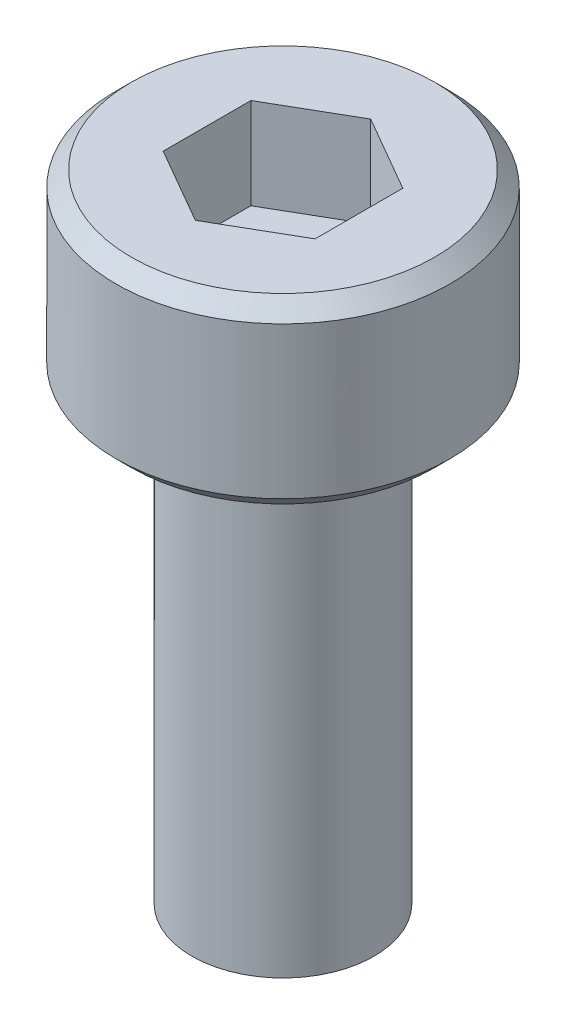
ISO-10303-21;
HEADER;
FILE_DESCRIPTION(('STEP AP214'),'2;1');
FILE_NAME('part.step','',(''),(''),'','','');
FILE_SCHEMA(('AUTOMOTIVE_DESIGN { 1 0 10303 214 1 1 1 1 }'));
ENDSEC;
DATA;
#1=APPLICATION_CONTEXT('core data for automotive mechanical design processes');
#2=APPLICATION_PROTOCOL_DEFINITION('international standard','automotive_design',2000,#1);
#3=PRODUCT_CONTEXT('',#1,'mechanical');
#4=PRODUCT('Part','Part','',(#3));
#5=PRODUCT_RELATED_PRODUCT_CATEGORY('part','',(#4));
#6=PRODUCT_DEFINITION_FORMATION('','',#4);
#7=PRODUCT_DEFINITION_CONTEXT('part definition',#1,'design');
#8=PRODUCT_DEFINITION('design','',#6,#7);
#9=PRODUCT_DEFINITION_SHAPE('','',#8);
#10=(LENGTH_UNIT() NAMED_UNIT(*) SI_UNIT(.MILLI.,.METRE.));
#11=(NAMED_UNIT(*) PLANE_ANGLE_UNIT() SI_UNIT($,.RADIAN.));
#12=(NAMED_UNIT(*) SI_UNIT($,.STERADIAN.) SOLID_ANGLE_UNIT());
#13=UNCERTAINTY_MEASURE_WITH_UNIT(LENGTH_MEASURE(1.E-05),#10,'distance_accuracy_value','');
#14=(GEOMETRIC_REPRESENTATION_CONTEXT(3) GLOBAL_UNCERTAINTY_ASSIGNED_CONTEXT((#13)) GLOBAL_UNIT_ASSIGNED_CONTEXT((#10,
#11,#12)) REPRESENTATION_CONTEXT('',''));
#15=CARTESIAN_POINT('',(0.,0.,0.));
#16=DIRECTION('',(0.,0.,1.));
#17=DIRECTION('',(1.,0.,0.));
#18=AXIS2_PLACEMENT_3D('',#15,#16,#17);
#19=CARTESIAN_POINT('',(-1.25,1.5,0.721687836487032));
#20=DIRECTION('',(0.,-1.,0.));
#21=DIRECTION('',(0.,0.,-1.));
#22=AXIS2_PLACEMENT_3D('',#19,#20,#21);
#23=PLANE('',#22);
#24=DIRECTION('',(0.866025403784439,0.,-0.5));
#25=VECTOR('',#24,1.);
#26=CARTESIAN_POINT('',(0.,1.5,1.44337567297406));
#27=LINE('',#26,#25);
#28=CARTESIAN_POINT('',(0.,1.5,1.44337567297406));
#29=VERTEX_POINT('',#28);
#30=CARTESIAN_POINT('',(1.25,1.5,0.721687836487032));
#31=VERTEX_POINT('',#30);
#32=EDGE_CURVE('E126',#29,#31,#27,.T.);
#33=ORIENTED_EDGE('',*,*,#32,.T.);
#34=DIRECTION('',(0.,0.,-1.));
#35=VECTOR('',#34,1.);
#36=CARTESIAN_POINT('',(1.25,1.5,0.721687836487032));
#37=LINE('',#36,#35);
#38=CARTESIAN_POINT('',(1.25,1.5,-0.721687836487032));
#39=VERTEX_POINT('',#38);
#40=EDGE_CURVE('E131',#31,#39,#37,.T.);
#41=ORIENTED_EDGE('',*,*,#40,.T.);
#42=DIRECTION('',(-0.866025403784439,0.,-0.5));
#43=VECTOR('',#42,1.);
#44=CARTESIAN_POINT('',(1.25,1.5,-0.721687836487032));
#45=LINE('',#44,#43);
#46=CARTESIAN_POINT('',(0.,1.5,-1.44337567297406));
#47=VERTEX_POINT('',#46);
#48=EDGE_CURVE('E135',#39,#47,#45,.T.);
#49=ORIENTED_EDGE('',*,*,#48,.T.);
#50=DIRECTION('',(-0.866025403784439,0.,0.5));
#51=VECTOR('',#50,1.);
#52=CARTESIAN_POINT('',(0.,1.5,-1.44337567297406));
#53=LINE('',#52,#51);
#54=CARTESIAN_POINT('',(-1.25,1.5,-0.721687836487032));
#55=VERTEX_POINT('',#54);
#56=EDGE_CURVE('E67',#47,#55,#53,.T.);
#57=ORIENTED_EDGE('',*,*,#56,.T.);
#58=DIRECTION('',(0.,0.,1.));
#59=VECTOR('',#58,1.);
#60=CARTESIAN_POINT('',(-1.25,1.5,-0.721687836487032));
#61=LINE('',#60,#59);
#62=CARTESIAN_POINT('',(-1.25,1.5,0.721687836487033));
#63=VERTEX_POINT('',#62);
#64=EDGE_CURVE('E69',#55,#63,#61,.T.);
#65=ORIENTED_EDGE('',*,*,#64,.T.);
#66=DIRECTION('',(0.866025403784439,0.,0.5));
#67=VECTOR('',#66,1.);
#68=CARTESIAN_POINT('',(-1.25,1.5,0.721687836487032));
#69=LINE('',#68,#67);
#70=EDGE_CURVE('E71',#63,#29,#69,.T.);
#71=ORIENTED_EDGE('',*,*,#70,.T.);
#72=EDGE_LOOP('',(#33,#41,#49,#57,#65,#71));
#73=FACE_BOUND('',#72,.T.);
#74=ADVANCED_FACE('F16',(#73),#23,.F.);
#75=CARTESIAN_POINT('',(-1.25,1.5,0.721687836487032));
#76=DIRECTION('',(-0.5,0.,0.866025403784439));
#77=DIRECTION('',(0.866025403784439,0.,0.5));
#78=AXIS2_PLACEMENT_3D('',#75,#76,#77);
#79=PLANE('',#78);
#80=DIRECTION('',(0.,1.,0.));
#81=VECTOR('',#80,1.);
#82=CARTESIAN_POINT('',(0.,1.5,1.44337567297406));
#83=LINE('',#82,#81);
#84=CARTESIAN_POINT('',(0.,3.,1.44337567297406));
#85=VERTEX_POINT('',#84);
#86=EDGE_CURVE('E82',#85,#29,#83,.F.);
#87=ORIENTED_EDGE('',*,*,#86,.T.);
#88=ORIENTED_EDGE('',*,*,#70,.F.);
#89=DIRECTION('',(0.,1.,0.));
#90=VECTOR('',#89,1.);
#91=CARTESIAN_POINT('',(-1.25,1.5,0.721687836487032));
#92=LINE('',#91,#90);
#93=CARTESIAN_POINT('',(-1.25,3.,0.721687836487032));
#94=VERTEX_POINT('',#93);
#95=EDGE_CURVE('E76',#63,#94,#92,.T.);
#96=ORIENTED_EDGE('',*,*,#95,.T.);
#97=DIRECTION('',(-0.866025403784439,0.,-0.5));
#98=VECTOR('',#97,1.);
#99=CARTESIAN_POINT('',(0.,3.,1.44337567297406));
#100=LINE('',#99,#98);
#101=EDGE_CURVE('E123',#85,#94,#100,.T.);
#102=ORIENTED_EDGE('',*,*,#101,.F.);
#103=EDGE_LOOP('',(#87,#88,#96,#102));
#104=FACE_BOUND('',#103,.T.);
#105=ADVANCED_FACE('F79',(#104),#79,.F.);
#106=CARTESIAN_POINT('',(-1.25,1.5,-0.721687836487032));
#107=DIRECTION('',(-1.,0.,0.));
#108=DIRECTION('',(0.,0.,1.));
#109=AXIS2_PLACEMENT_3D('',#106,#107,#108);
#110=PLANE('',#109);
#111=ORIENTED_EDGE('',*,*,#95,.F.);
#112=ORIENTED_EDGE('',*,*,#64,.F.);
#113=DIRECTION('',(0.,1.,0.));
#114=VECTOR('',#113,1.);
#115=CARTESIAN_POINT('',(-1.25,1.5,-0.721687836487032));
#116=LINE('',#115,#114);
#117=CARTESIAN_POINT('',(-1.25,3.,-0.721687836487032));
#118=VERTEX_POINT('',#117);
#119=EDGE_CURVE('E90',#55,#118,#116,.T.);
#120=ORIENTED_EDGE('',*,*,#119,.T.);
#121=DIRECTION('',(0.,0.,1.));
#122=VECTOR('',#121,1.);
#123=CARTESIAN_POINT('',(-1.25,3.,0.));
#124=LINE('',#123,#122);
#125=EDGE_CURVE('E87',#94,#118,#124,.F.);
#126=ORIENTED_EDGE('',*,*,#125,.F.);
#127=EDGE_LOOP('',(#111,#112,#120,#126));
#128=FACE_BOUND('',#127,.T.);
#129=ADVANCED_FACE('F85',(#128),#110,.F.);
#130=CARTESIAN_POINT('',(0.,1.5,-1.44337567297406));
#131=DIRECTION('',(-0.5,0.,-0.866025403784439));
#132=DIRECTION('',(-0.866025403784439,0.,0.5));
#133=AXIS2_PLACEMENT_3D('',#130,#131,#132);
#134=PLANE('',#133);
#135=ORIENTED_EDGE('',*,*,#119,.F.);
#136=ORIENTED_EDGE('',*,*,#56,.F.);
#137=DIRECTION('',(0.,1.,0.));
#138=VECTOR('',#137,1.);
#139=CARTESIAN_POINT('',(0.,1.5,-1.44337567297406));
#140=LINE('',#139,#138);
#141=CARTESIAN_POINT('',(0.,3.,-1.44337567297406));
#142=VERTEX_POINT('',#141);
#143=EDGE_CURVE('E133',#47,#142,#140,.T.);
#144=ORIENTED_EDGE('',*,*,#143,.T.);
#145=DIRECTION('',(0.866025403784439,0.,-0.5));
#146=VECTOR('',#145,1.);
#147=CARTESIAN_POINT('',(-1.25,3.,-0.721687836487032));
#148=LINE('',#147,#146);
#149=EDGE_CURVE('E119',#118,#142,#148,.T.);
#150=ORIENTED_EDGE('',*,*,#149,.F.);
#151=EDGE_LOOP('',(#135,#136,#144,#150));
#152=FACE_BOUND('',#151,.T.);
#153=ADVANCED_FACE('F138',(#152),#134,.F.);
#154=CARTESIAN_POINT('',(1.25,1.5,-0.721687836487032));
#155=DIRECTION('',(0.5,0.,-0.866025403784439));
#156=DIRECTION('',(-0.866025403784439,0.,-0.5));
#157=AXIS2_PLACEMENT_3D('',#154,#155,#156);
#158=PLANE('',#157);
#159=ORIENTED_EDGE('',*,*,#143,.F.);
#160=ORIENTED_EDGE('',*,*,#48,.F.);
#161=DIRECTION('',(0.,1.,0.));
#162=VECTOR('',#161,1.);
#163=CARTESIAN_POINT('',(1.25,1.5,-0.721687836487032));
#164=LINE('',#163,#162);
#165=CARTESIAN_POINT('',(1.25,3.,-0.721687836487032));
#166=VERTEX_POINT('',#165);
#167=EDGE_CURVE('E129',#39,#166,#164,.T.);
#168=ORIENTED_EDGE('',*,*,#167,.T.);
#169=DIRECTION('',(0.866025403784438,0.,0.5));
#170=VECTOR('',#169,1.);
#171=CARTESIAN_POINT('',(0.,3.,-1.44337567297406));
#172=LINE('',#171,#170);
#173=EDGE_CURVE('E116',#142,#166,#172,.T.);
#174=ORIENTED_EDGE('',*,*,#173,.F.);
#175=EDGE_LOOP('',(#159,#160,#168,#174));
#176=FACE_BOUND('',#175,.T.);
#177=ADVANCED_FACE('F150',(#176),#158,.F.);
#178=CARTESIAN_POINT('',(1.25,1.5,0.721687836487032));
#179=DIRECTION('',(1.,0.,0.));
#180=DIRECTION('',(0.,0.,-1.));
#181=AXIS2_PLACEMENT_3D('',#178,#179,#180);
#182=PLANE('',#181);
#183=ORIENTED_EDGE('',*,*,#167,.F.);
#184=ORIENTED_EDGE('',*,*,#40,.F.);
#185=DIRECTION('',(0.,1.,0.));
#186=VECTOR('',#185,1.);
#187=CARTESIAN_POINT('',(1.25,1.5,0.721687836487032));
#188=LINE('',#187,#186);
#189=CARTESIAN_POINT('',(1.25,3.,0.721687836487032));
#190=VERTEX_POINT('',#189);
#191=EDGE_CURVE('E34',#31,#190,#188,.T.);
#192=ORIENTED_EDGE('',*,*,#191,.T.);
#193=DIRECTION('',(0.,0.,1.));
#194=VECTOR('',#193,1.);
#195=CARTESIAN_POINT('',(1.25,3.,0.));
#196=LINE('',#195,#194);
#197=EDGE_CURVE('E113',#166,#190,#196,.T.);
#198=ORIENTED_EDGE('',*,*,#197,.F.);
#199=EDGE_LOOP('',(#183,#184,#192,#198));
#200=FACE_BOUND('',#199,.T.);
#201=ADVANCED_FACE('F148',(#200),#182,.F.);
#202=CARTESIAN_POINT('',(0.,1.5,1.44337567297406));
#203=DIRECTION('',(0.5,0.,0.866025403784439));
#204=DIRECTION('',(0.866025403784439,0.,-0.5));
#205=AXIS2_PLACEMENT_3D('',#202,#203,#204);
#206=PLANE('',#205);
#207=ORIENTED_EDGE('',*,*,#191,.F.);
#208=ORIENTED_EDGE('',*,*,#32,.F.);
#209=ORIENTED_EDGE('',*,*,#86,.F.);
#210=DIRECTION('',(-0.866025403784439,0.,0.5));
#211=VECTOR('',#210,1.);
#212=CARTESIAN_POINT('',(1.25,3.,0.721687836487032));
#213=LINE('',#212,#211);
#214=EDGE_CURVE('E110',#190,#85,#213,.T.);
#215=ORIENTED_EDGE('',*,*,#214,.F.);
#216=EDGE_LOOP('',(#207,#208,#209,#215));
#217=FACE_BOUND('',#216,.T.);
#218=ADVANCED_FACE('F145',(#217),#206,.F.);
#219=CARTESIAN_POINT('',(0.,3.,0.));
#220=DIRECTION('',(0.,1.,0.));
#221=DIRECTION('',(0.,0.,1.));
#222=AXIS2_PLACEMENT_3D('',#219,#220,#221);
#223=PLANE('',#222);
#224=ORIENTED_EDGE('',*,*,#197,.T.);
#225=ORIENTED_EDGE('',*,*,#214,.T.);
#226=ORIENTED_EDGE('',*,*,#101,.T.);
#227=ORIENTED_EDGE('',*,*,#125,.T.);
#228=ORIENTED_EDGE('',*,*,#149,.T.);
#229=ORIENTED_EDGE('',*,*,#173,.T.);
#230=EDGE_LOOP('',(#224,#225,#226,#227,#228,#229));
#231=FACE_BOUND('',#230,.T.);
#232=CARTESIAN_POINT('',(0.,3.00000000004275,0.));
#233=DIRECTION('',(0.,-1.,0.));
#234=DIRECTION('',(0.,0.,-1.));
#235=AXIS2_PLACEMENT_3D('',#232,#233,#234);
#236=CIRCLE('',#235,2.49600000000783);
#237=CARTESIAN_POINT('',(0.,3.00000000004275,-2.49600000000783));
#238=VERTEX_POINT('',#237);
#239=EDGE_CURVE('E19',#238,#238,#236,.T.);
#240=ORIENTED_EDGE('',*,*,#239,.F.);
#241=EDGE_LOOP('',(#240));
#242=FACE_BOUND('',#241,.T.);
#243=ADVANCED_FACE('F142',(#231,#242),#223,.T.);
#244=CARTESIAN_POINT('',(0.,2.7460000001156,0.));
#245=DIRECTION('',(0.,-1.,0.));
#246=DIRECTION('',(0.,0.,-1.));
#247=AXIS2_PLACEMENT_3D('',#244,#245,#246);
#248=CONICAL_SURFACE('',#247,2.74999999993497,0.785398163397448);
#249=ORIENTED_EDGE('',*,*,#239,.T.);
#250=EDGE_LOOP('',(#249));
#251=FACE_BOUND('',#250,.T.);
#252=CARTESIAN_POINT('',(0.,2.746,0.));
#253=DIRECTION('',(0.,-1.,0.));
#254=DIRECTION('',(0.,0.,-1.));
#255=AXIS2_PLACEMENT_3D('',#252,#253,#254);
#256=CIRCLE('',#255,2.75);
#257=CARTESIAN_POINT('',(0.,2.746,-2.75));
#258=VERTEX_POINT('',#257);
#259=EDGE_CURVE('E102',#258,#258,#256,.T.);
#260=ORIENTED_EDGE('',*,*,#259,.F.);
#261=EDGE_LOOP('',(#260));
#262=FACE_BOUND('',#261,.T.);
#263=ADVANCED_FACE('F187',(#251,#262),#248,.T.);
#264=CARTESIAN_POINT('',(0.,3.,0.));
#265=DIRECTION('',(0.,-1.,0.));
#266=DIRECTION('',(0.,0.,-1.));
#267=AXIS2_PLACEMENT_3D('',#264,#265,#266);
#268=CYLINDRICAL_SURFACE('',#267,2.75);
#269=ORIENTED_EDGE('',*,*,#259,.T.);
#270=EDGE_LOOP('',(#269));
#271=FACE_BOUND('',#270,.T.);
#272=CARTESIAN_POINT('',(0.,0.253999999983989,0.));
#273=DIRECTION('',(0.,1.,0.));
#274=DIRECTION('',(0.,0.,1.));
#275=AXIS2_PLACEMENT_3D('',#272,#273,#274);
#276=CIRCLE('',#275,2.74999999999181);
#277=CARTESIAN_POINT('',(0.,0.253999999983989,2.74999999999181));
#278=VERTEX_POINT('',#277);
#279=EDGE_CURVE('E98',#278,#278,#276,.F.);
#280=ORIENTED_EDGE('',*,*,#279,.F.);
#281=EDGE_LOOP('',(#280));
#282=FACE_BOUND('',#281,.T.);
#283=ADVANCED_FACE('F183',(#271,#282),#268,.T.);
#284=CARTESIAN_POINT('',(0.,-8.,0.));
#285=DIRECTION('',(0.,1.,0.));
#286=DIRECTION('',(0.,0.,1.));
#287=AXIS2_PLACEMENT_3D('',#284,#285,#286);
#288=PLANE('',#287);
#289=CARTESIAN_POINT('',(0.,-7.99999999998136,0.));
#290=DIRECTION('',(0.,1.,0.));
#291=DIRECTION('',(-1.,0.,0.));
#292=AXIS2_PLACEMENT_3D('',#289,#290,#291);
#293=CIRCLE('',#292,0.730379999993147);
#294=CARTESIAN_POINT('',(-0.730379999993147,-7.99999999998136,0.));
#295=VERTEX_POINT('',#294);
#296=EDGE_CURVE('E96',#295,#295,#293,.T.);
#297=ORIENTED_EDGE('',*,*,#296,.F.);
#298=EDGE_LOOP('',(#297));
#299=FACE_BOUND('',#298,.T.);
#300=ADVANCED_FACE('F179',(#299),#288,.F.);
#301=CARTESIAN_POINT('',(0.,0.254000000040833,0.));
#302=DIRECTION('',(0.,1.,0.));
#303=DIRECTION('',(0.,0.,1.));
#304=AXIS2_PLACEMENT_3D('',#301,#302,#303);
#305=CONICAL_SURFACE('',#304,2.7500000001055,0.785398163397448);
#306=CARTESIAN_POINT('',(0.,0.,0.));
#307=DIRECTION('',(0.,1.,0.));
#308=DIRECTION('',(0.,0.,1.));
#309=AXIS2_PLACEMENT_3D('',#306,#307,#308);
#310=CIRCLE('',#309,2.49600000006467);
#311=CARTESIAN_POINT('',(0.,0.,2.49600000006467));
#312=VERTEX_POINT('',#311);
#313=EDGE_CURVE('E94',#312,#312,#310,.T.);
#314=ORIENTED_EDGE('',*,*,#313,.T.);
#315=EDGE_LOOP('',(#314));
#316=FACE_BOUND('',#315,.T.);
#317=ORIENTED_EDGE('',*,*,#279,.T.);
#318=EDGE_LOOP('',(#317));
#319=FACE_BOUND('',#318,.T.);
#320=ADVANCED_FACE('F175',(#316,#319),#305,.T.);
#321=CARTESIAN_POINT('',(0.,-7.46151999993572,0.));
#322=DIRECTION('',(0.,1.,0.));
#323=DIRECTION('',(-1.,0.,0.));
#324=AXIS2_PLACEMENT_3D('',#321,#322,#323);
#325=CONICAL_SURFACE('',#324,1.50000000002137,0.960291895387899);
#326=CARTESIAN_POINT('',(0.,-7.46152,0.));
#327=DIRECTION('',(0.,1.,0.));
#328=DIRECTION('',(0.,0.,1.));
#329=AXIS2_PLACEMENT_3D('',#326,#327,#328);
#330=CIRCLE('',#329,1.5);
#331=CARTESIAN_POINT('',(0.,-7.46152,1.5));
#332=VERTEX_POINT('',#331);
#333=EDGE_CURVE('E25',#332,#332,#330,.T.);
#334=ORIENTED_EDGE('',*,*,#333,.F.);
#335=EDGE_LOOP('',(#334));
#336=FACE_BOUND('',#335,.T.);
#337=ORIENTED_EDGE('',*,*,#296,.T.);
#338=EDGE_LOOP('',(#337));
#339=FACE_BOUND('',#338,.T.);
#340=ADVANCED_FACE('F168',(#336,#339),#325,.T.);
#341=CARTESIAN_POINT('',(0.,0.,0.));
#342=DIRECTION('',(0.,1.,0.));
#343=DIRECTION('',(0.,0.,1.));
#344=AXIS2_PLACEMENT_3D('',#341,#342,#343);
#345=PLANE('',#344);
#346=CARTESIAN_POINT('',(0.,0.,0.));
#347=DIRECTION('',(0.,1.,0.));
#348=DIRECTION('',(0.,0.,1.));
#349=AXIS2_PLACEMENT_3D('',#346,#347,#348);
#350=CIRCLE('',#349,1.5);
#351=CARTESIAN_POINT('',(0.,0.,1.5));
#352=VERTEX_POINT('',#351);
#353=EDGE_CURVE('E11',#352,#352,#350,.F.);
#354=ORIENTED_EDGE('',*,*,#353,.F.);
#355=EDGE_LOOP('',(#354));
#356=FACE_BOUND('',#355,.T.);
#357=ORIENTED_EDGE('',*,*,#313,.F.);
#358=EDGE_LOOP('',(#357));
#359=FACE_BOUND('',#358,.T.);
#360=ADVANCED_FACE('F162',(#356,#359),#345,.F.);
#361=CARTESIAN_POINT('',(0.,-8.,0.));
#362=DIRECTION('',(0.,1.,0.));
#363=DIRECTION('',(0.,0.,1.));
#364=AXIS2_PLACEMENT_3D('',#361,#362,#363);
#365=CYLINDRICAL_SURFACE('',#364,1.5);
#366=ORIENTED_EDGE('',*,*,#353,.T.);
#367=EDGE_LOOP('',(#366));
#368=FACE_BOUND('',#367,.T.);
#369=ORIENTED_EDGE('',*,*,#333,.T.);
#370=EDGE_LOOP('',(#369));
#371=FACE_BOUND('',#370,.T.);
#372=ADVANCED_FACE('F160',(#368,#371),#365,.T.);
#373=CLOSED_SHELL('',(#74,#105,#129,#153,#177,#201,#218,#243,#263,#283,#300,#320,#340,#360,#372));
#374=MANIFOLD_SOLID_BREP('B1',#373);
#375=ADVANCED_BREP_SHAPE_REPRESENTATION('',(#18,#374),#14);
#376=SHAPE_DEFINITION_REPRESENTATION(#9,#375);
ENDSEC;
END-ISO-10303-21;
